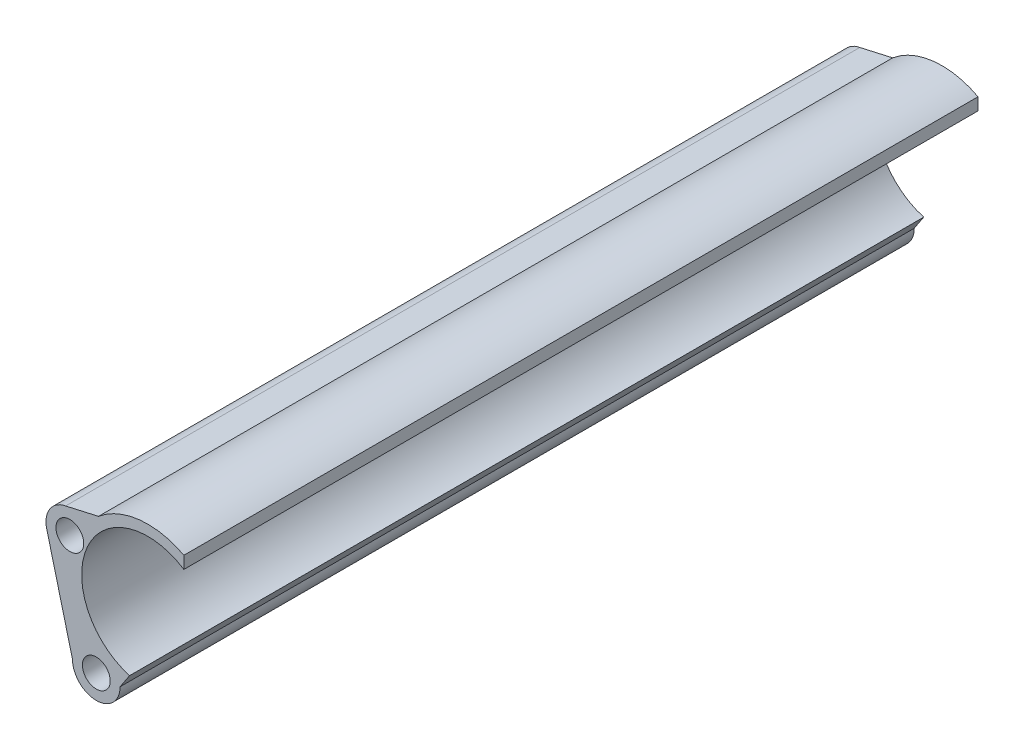
ISO-10303-21;
HEADER;
FILE_DESCRIPTION(('STEP AP214'),'2;1');
FILE_NAME('part.step','',(''),(''),'','','');
FILE_SCHEMA(('AUTOMOTIVE_DESIGN { 1 0 10303 214 1 1 1 1 }'));
ENDSEC;
DATA;
#1=APPLICATION_CONTEXT('core data for automotive mechanical design processes');
#2=APPLICATION_PROTOCOL_DEFINITION('international standard','automotive_design',2000,#1);
#3=PRODUCT_CONTEXT('',#1,'mechanical');
#4=PRODUCT('Part','Part','',(#3));
#5=PRODUCT_RELATED_PRODUCT_CATEGORY('part','',(#4));
#6=PRODUCT_DEFINITION_FORMATION('','',#4);
#7=PRODUCT_DEFINITION_CONTEXT('part definition',#1,'design');
#8=PRODUCT_DEFINITION('design','',#6,#7);
#9=PRODUCT_DEFINITION_SHAPE('','',#8);
#10=(LENGTH_UNIT() NAMED_UNIT(*) SI_UNIT(.MILLI.,.METRE.));
#11=(NAMED_UNIT(*) PLANE_ANGLE_UNIT() SI_UNIT($,.RADIAN.));
#12=(NAMED_UNIT(*) SI_UNIT($,.STERADIAN.) SOLID_ANGLE_UNIT());
#13=UNCERTAINTY_MEASURE_WITH_UNIT(LENGTH_MEASURE(1.E-05),#10,'distance_accuracy_value','');
#14=(GEOMETRIC_REPRESENTATION_CONTEXT(3) GLOBAL_UNCERTAINTY_ASSIGNED_CONTEXT((#13)) GLOBAL_UNIT_ASSIGNED_CONTEXT((#10,
#11,#12)) REPRESENTATION_CONTEXT('',''));
#15=CARTESIAN_POINT('',(0.,0.,0.));
#16=DIRECTION('',(0.,0.,1.));
#17=DIRECTION('',(1.,0.,0.));
#18=AXIS2_PLACEMENT_3D('',#15,#16,#17);
#19=CARTESIAN_POINT('',(21.5406787545616,4.51282461500229E-13,150.));
#20=DIRECTION('',(1.,0.,0.));
#21=DIRECTION('',(0.,1.,0.));
#22=AXIS2_PLACEMENT_3D('',#19,#20,#21);
#23=PLANE('',#22);
#24=DIRECTION('',(0.,-1.,0.));
#25=VECTOR('',#24,1.);
#26=CARTESIAN_POINT('',(21.5406787545616,4.51282461500229E-13,0.));
#27=LINE('',#26,#25);
#28=CARTESIAN_POINT('',(21.5406787545615,7.53128151458365,0.));
#29=VERTEX_POINT('',#28);
#30=CARTESIAN_POINT('',(21.5406787545615,5.21282360688181,0.));
#31=VERTEX_POINT('',#30);
#32=EDGE_CURVE('E135',#29,#31,#27,.T.);
#33=ORIENTED_EDGE('',*,*,#32,.F.);
#34=DIRECTION('',(0.,0.,-1.));
#35=VECTOR('',#34,1.);
#36=CARTESIAN_POINT('',(21.5406787545615,7.53128151458365,150.));
#37=LINE('',#36,#35);
#38=CARTESIAN_POINT('',(21.5406787545615,7.53128151458365,150.));
#39=VERTEX_POINT('',#38);
#40=EDGE_CURVE('E11',#39,#29,#37,.T.);
#41=ORIENTED_EDGE('',*,*,#40,.F.);
#42=DIRECTION('',(0.,-1.,0.));
#43=VECTOR('',#42,1.);
#44=CARTESIAN_POINT('',(21.5406787545616,4.51282461500229E-13,150.));
#45=LINE('',#44,#43);
#46=CARTESIAN_POINT('',(21.5406787545615,5.21282360688181,150.));
#47=VERTEX_POINT('',#46);
#48=EDGE_CURVE('E297',#39,#47,#45,.T.);
#49=ORIENTED_EDGE('',*,*,#48,.T.);
#50=DIRECTION('',(0.,0.,-1.));
#51=VECTOR('',#50,1.);
#52=CARTESIAN_POINT('',(21.5406787545615,5.21282360688181,150.));
#53=LINE('',#52,#51);
#54=EDGE_CURVE('E52',#47,#31,#53,.T.);
#55=ORIENTED_EDGE('',*,*,#54,.T.);
#56=EDGE_LOOP('',(#33,#41,#49,#55));
#57=FACE_BOUND('',#56,.T.);
#58=ADVANCED_FACE('F35',(#57),#23,.T.);
#59=CARTESIAN_POINT('',(14.7374063577215,-5.27361929309128,150.));
#60=DIRECTION('',(0.,0.,-1.));
#61=DIRECTION('',(-1.,0.,0.));
#62=AXIS2_PLACEMENT_3D('',#59,#60,#61);
#63=CYLINDRICAL_SURFACE('',#62,14.5);
#64=CARTESIAN_POINT('',(14.7374063577215,-5.27361929309128,0.));
#65=DIRECTION('',(0.,0.,1.));
#66=DIRECTION('',(1.,0.,0.));
#67=AXIS2_PLACEMENT_3D('',#64,#65,#66);
#68=CIRCLE('',#67,14.5);
#69=CARTESIAN_POINT('',(5.41957654231585,5.83619832607501,0.));
#70=VERTEX_POINT('',#69);
#71=EDGE_CURVE('E137',#29,#70,#68,.T.);
#72=ORIENTED_EDGE('',*,*,#71,.T.);
#73=DIRECTION('',(0.,0.,-1.));
#74=VECTOR('',#73,1.);
#75=CARTESIAN_POINT('',(5.41957654231585,5.83619832607501,150.));
#76=LINE('',#75,#74);
#77=CARTESIAN_POINT('',(5.41957654231585,5.83619832607501,150.));
#78=VERTEX_POINT('',#77);
#79=EDGE_CURVE('E44',#78,#70,#76,.T.);
#80=ORIENTED_EDGE('',*,*,#79,.F.);
#81=CARTESIAN_POINT('',(14.7374063577215,-5.27361929309128,150.));
#82=DIRECTION('',(0.,0.,1.));
#83=DIRECTION('',(1.,0.,0.));
#84=AXIS2_PLACEMENT_3D('',#81,#82,#83);
#85=CIRCLE('',#84,14.5);
#86=EDGE_CURVE('E293',#39,#78,#85,.T.);
#87=ORIENTED_EDGE('',*,*,#86,.F.);
#88=ORIENTED_EDGE('',*,*,#40,.T.);
#89=EDGE_LOOP('',(#72,#80,#87,#88));
#90=FACE_BOUND('',#89,.T.);
#91=ADVANCED_FACE('F174',(#90),#63,.T.);
#92=CARTESIAN_POINT('',(-0.992590841324967,4.38460661520937,150.));
#93=DIRECTION('',(0.220793854202999,-0.975320498065218,0.));
#94=DIRECTION('',(0.975320498065218,0.220793854202999,0.));
#95=AXIS2_PLACEMENT_3D('',#92,#93,#94);
#96=PLANE('',#95);
#97=DIRECTION('',(-0.975320498065218,-0.220793854202999,0.));
#98=VECTOR('',#97,1.);
#99=CARTESIAN_POINT('',(-0.992590841324967,4.38460661520937,0.));
#100=LINE('',#99,#98);
#101=CARTESIAN_POINT('',(-0.797555390004435,4.42875890062602,0.));
#102=VERTEX_POINT('',#101);
#103=EDGE_CURVE('E140',#70,#102,#100,.T.);
#104=ORIENTED_EDGE('',*,*,#103,.T.);
#105=DIRECTION('',(0.,0.,-1.));
#106=VECTOR('',#105,1.);
#107=CARTESIAN_POINT('',(-0.797555390004435,4.42875890062602,150.));
#108=LINE('',#107,#106);
#109=CARTESIAN_POINT('',(-0.797555390004435,4.42875890062602,150.));
#110=VERTEX_POINT('',#109);
#111=EDGE_CURVE('E162',#110,#102,#108,.T.);
#112=ORIENTED_EDGE('',*,*,#111,.F.);
#113=DIRECTION('',(-0.975320498065218,-0.220793854202999,0.));
#114=VECTOR('',#113,1.);
#115=CARTESIAN_POINT('',(-0.992590841324967,4.38460661520937,150.));
#116=LINE('',#115,#114);
#117=EDGE_CURVE('E170',#78,#110,#116,.T.);
#118=ORIENTED_EDGE('',*,*,#117,.F.);
#119=ORIENTED_EDGE('',*,*,#79,.T.);
#120=EDGE_LOOP('',(#104,#112,#118,#119));
#121=FACE_BOUND('',#120,.T.);
#122=ADVANCED_FACE('F167',(#121),#96,.F.);
#123=CARTESIAN_POINT('',(0.,0.,150.));
#124=DIRECTION('',(0.,0.,-1.));
#125=DIRECTION('',(-1.,0.,0.));
#126=AXIS2_PLACEMENT_3D('',#123,#124,#125);
#127=CYLINDRICAL_SURFACE('',#126,4.49999999999992);
#128=CARTESIAN_POINT('',(0.,0.,0.));
#129=DIRECTION('',(0.,0.,1.));
#130=DIRECTION('',(1.,0.,0.));
#131=AXIS2_PLACEMENT_3D('',#128,#129,#130);
#132=CIRCLE('',#131,4.49999999999992);
#133=CARTESIAN_POINT('',(-4.3580211919194,-1.12145052979643,0.));
#134=VERTEX_POINT('',#133);
#135=EDGE_CURVE('E143',#102,#134,#132,.T.);
#136=ORIENTED_EDGE('',*,*,#135,.T.);
#137=DIRECTION('',(0.,0.,-1.));
#138=VECTOR('',#137,1.);
#139=CARTESIAN_POINT('',(-4.3580211919194,-1.12145052979643,150.));
#140=LINE('',#139,#138);
#141=CARTESIAN_POINT('',(-4.3580211919194,-1.12145052979643,150.));
#142=VERTEX_POINT('',#141);
#143=EDGE_CURVE('E159',#142,#134,#140,.T.);
#144=ORIENTED_EDGE('',*,*,#143,.F.);
#145=CARTESIAN_POINT('',(0.,0.,150.));
#146=DIRECTION('',(0.,0.,1.));
#147=DIRECTION('',(1.,0.,0.));
#148=AXIS2_PLACEMENT_3D('',#145,#146,#147);
#149=CIRCLE('',#148,4.49999999999992);
#150=EDGE_CURVE('E291',#110,#142,#149,.T.);
#151=ORIENTED_EDGE('',*,*,#150,.F.);
#152=ORIENTED_EDGE('',*,*,#111,.T.);
#153=EDGE_LOOP('',(#136,#144,#151,#152));
#154=FACE_BOUND('',#153,.T.);
#155=ADVANCED_FACE('F216',(#154),#127,.T.);
#156=CARTESIAN_POINT('',(-4.35802119191901,-1.12145052979794,150.));
#157=DIRECTION('',(0.968449153759797,0.249211228843991,0.));
#158=DIRECTION('',(-0.249211228843991,0.968449153759797,0.));
#159=AXIS2_PLACEMENT_3D('',#156,#157,#158);
#160=PLANE('',#159);
#161=DIRECTION('',(0.249211228843991,-0.968449153759797,0.));
#162=VECTOR('',#161,1.);
#163=CARTESIAN_POINT('',(-4.35802119191901,-1.12145052979794,0.));
#164=LINE('',#163,#162);
#165=CARTESIAN_POINT('',(0.500000000000005,-20.,0.));
#166=VERTEX_POINT('',#165);
#167=EDGE_CURVE('E146',#134,#166,#164,.T.);
#168=ORIENTED_EDGE('',*,*,#167,.T.);
#169=DIRECTION('',(0.,0.,-1.));
#170=VECTOR('',#169,1.);
#171=CARTESIAN_POINT('',(0.500000000000005,-20.,150.));
#172=LINE('',#171,#170);
#173=CARTESIAN_POINT('',(0.500000000000005,-20.,150.));
#174=VERTEX_POINT('',#173);
#175=EDGE_CURVE('E121',#174,#166,#172,.T.);
#176=ORIENTED_EDGE('',*,*,#175,.F.);
#177=DIRECTION('',(0.249211228843991,-0.968449153759797,0.));
#178=VECTOR('',#177,1.);
#179=CARTESIAN_POINT('',(-4.35802119191901,-1.12145052979794,150.));
#180=LINE('',#179,#178);
#181=EDGE_CURVE('E110',#142,#174,#180,.T.);
#182=ORIENTED_EDGE('',*,*,#181,.F.);
#183=ORIENTED_EDGE('',*,*,#143,.T.);
#184=EDGE_LOOP('',(#168,#176,#182,#183));
#185=FACE_BOUND('',#184,.T.);
#186=ADVANCED_FACE('F213',(#185),#160,.F.);
#187=CARTESIAN_POINT('',(5.,-20.,150.));
#188=DIRECTION('',(0.,0.,-1.));
#189=DIRECTION('',(-1.,0.,0.));
#190=AXIS2_PLACEMENT_3D('',#187,#188,#189);
#191=CYLINDRICAL_SURFACE('',#190,4.5);
#192=CARTESIAN_POINT('',(5.,-20.,0.));
#193=DIRECTION('',(0.,0.,1.));
#194=DIRECTION('',(1.,0.,0.));
#195=AXIS2_PLACEMENT_3D('',#192,#193,#194);
#196=CIRCLE('',#195,4.5);
#197=CARTESIAN_POINT('',(9.5,-20.,0.));
#198=VERTEX_POINT('',#197);
#199=EDGE_CURVE('E118',#166,#198,#196,.T.);
#200=ORIENTED_EDGE('',*,*,#199,.T.);
#201=DIRECTION('',(0.,0.,-1.));
#202=VECTOR('',#201,1.);
#203=CARTESIAN_POINT('',(9.5,-20.,150.));
#204=LINE('',#203,#202);
#205=CARTESIAN_POINT('',(9.5,-20.,150.));
#206=VERTEX_POINT('',#205);
#207=EDGE_CURVE('E116',#206,#198,#204,.T.);
#208=ORIENTED_EDGE('',*,*,#207,.F.);
#209=CARTESIAN_POINT('',(5.,-20.,150.));
#210=DIRECTION('',(0.,0.,1.));
#211=DIRECTION('',(1.,0.,0.));
#212=AXIS2_PLACEMENT_3D('',#209,#210,#211);
#213=CIRCLE('',#212,4.5);
#214=EDGE_CURVE('E102',#174,#206,#213,.T.);
#215=ORIENTED_EDGE('',*,*,#214,.F.);
#216=ORIENTED_EDGE('',*,*,#175,.T.);
#217=EDGE_LOOP('',(#200,#208,#215,#216));
#218=FACE_BOUND('',#217,.T.);
#219=ADVANCED_FACE('F117',(#218),#191,.T.);
#220=CARTESIAN_POINT('',(15.8131741889703,-10.4107028907879,150.));
#221=DIRECTION('',(0.835240024776836,-0.54988553446221,0.));
#222=DIRECTION('',(0.54988553446221,0.835240024776836,0.));
#223=AXIS2_PLACEMENT_3D('',#220,#221,#222);
#224=PLANE('',#223);
#225=DIRECTION('',(-0.54988553446221,-0.835240024776836,0.));
#226=VECTOR('',#225,1.);
#227=CARTESIAN_POINT('',(15.8131741889703,-10.4107028907879,0.));
#228=LINE('',#227,#226);
#229=CARTESIAN_POINT('',(11.2857217695841,-17.2876058714098,0.));
#230=VERTEX_POINT('',#229);
#231=EDGE_CURVE('E150',#230,#198,#228,.T.);
#232=ORIENTED_EDGE('',*,*,#231,.F.);
#233=DIRECTION('',(0.,0.,-1.));
#234=VECTOR('',#233,1.);
#235=CARTESIAN_POINT('',(11.2857217695841,-17.2876058714098,150.));
#236=LINE('',#235,#234);
#237=CARTESIAN_POINT('',(11.2857217695841,-17.2876058714098,150.));
#238=VERTEX_POINT('',#237);
#239=EDGE_CURVE('E77',#238,#230,#236,.T.);
#240=ORIENTED_EDGE('',*,*,#239,.F.);
#241=DIRECTION('',(-0.54988553446221,-0.835240024776836,0.));
#242=VECTOR('',#241,1.);
#243=CARTESIAN_POINT('',(15.8131741889703,-10.4107028907879,150.));
#244=LINE('',#243,#242);
#245=EDGE_CURVE('E108',#238,#206,#244,.T.);
#246=ORIENTED_EDGE('',*,*,#245,.T.);
#247=ORIENTED_EDGE('',*,*,#207,.T.);
#248=EDGE_LOOP('',(#232,#240,#246,#247));
#249=FACE_BOUND('',#248,.T.);
#250=ADVANCED_FACE('F123',(#249),#224,.T.);
#251=CARTESIAN_POINT('',(5.,-20.,150.));
#252=DIRECTION('',(0.,0.,-1.));
#253=DIRECTION('',(-1.,0.,0.));
#254=AXIS2_PLACEMENT_3D('',#251,#252,#253);
#255=CYLINDRICAL_SURFACE('',#254,2.625);
#256=CARTESIAN_POINT('',(5.,-20.,150.));
#257=DIRECTION('',(0.,0.,1.));
#258=DIRECTION('',(1.,0.,0.));
#259=AXIS2_PLACEMENT_3D('',#256,#257,#258);
#260=CIRCLE('',#259,2.625);
#261=CARTESIAN_POINT('',(7.625,-20.,150.));
#262=VERTEX_POINT('',#261);
#263=EDGE_CURVE('E197',#262,#262,#260,.T.);
#264=ORIENTED_EDGE('',*,*,#263,.T.);
#265=EDGE_LOOP('',(#264));
#266=FACE_BOUND('',#265,.T.);
#267=CARTESIAN_POINT('',(5.,-20.,0.));
#268=DIRECTION('',(0.,0.,1.));
#269=DIRECTION('',(1.,0.,0.));
#270=AXIS2_PLACEMENT_3D('',#267,#268,#269);
#271=CIRCLE('',#270,2.625);
#272=CARTESIAN_POINT('',(7.625,-20.,0.));
#273=VERTEX_POINT('',#272);
#274=EDGE_CURVE('E132',#273,#273,#271,.T.);
#275=ORIENTED_EDGE('',*,*,#274,.F.);
#276=EDGE_LOOP('',(#275));
#277=FACE_BOUND('',#276,.T.);
#278=ADVANCED_FACE('F184',(#266,#277),#255,.F.);
#279=CARTESIAN_POINT('',(0.,0.,150.));
#280=DIRECTION('',(0.,0.,-1.));
#281=DIRECTION('',(-1.,0.,0.));
#282=AXIS2_PLACEMENT_3D('',#279,#280,#281);
#283=CYLINDRICAL_SURFACE('',#282,2.625);
#284=CARTESIAN_POINT('',(0.,0.,150.));
#285=DIRECTION('',(0.,0.,1.));
#286=DIRECTION('',(1.,0.,0.));
#287=AXIS2_PLACEMENT_3D('',#284,#285,#286);
#288=CIRCLE('',#287,2.625);
#289=CARTESIAN_POINT('',(2.625,0.,150.));
#290=VERTEX_POINT('',#289);
#291=EDGE_CURVE('E155',#290,#290,#288,.T.);
#292=ORIENTED_EDGE('',*,*,#291,.T.);
#293=EDGE_LOOP('',(#292));
#294=FACE_BOUND('',#293,.T.);
#295=CARTESIAN_POINT('',(0.,0.,0.));
#296=DIRECTION('',(0.,0.,1.));
#297=DIRECTION('',(1.,0.,0.));
#298=AXIS2_PLACEMENT_3D('',#295,#296,#297);
#299=CIRCLE('',#298,2.625);
#300=CARTESIAN_POINT('',(2.625,0.,0.));
#301=VERTEX_POINT('',#300);
#302=EDGE_CURVE('E129',#301,#301,#299,.T.);
#303=ORIENTED_EDGE('',*,*,#302,.F.);
#304=EDGE_LOOP('',(#303));
#305=FACE_BOUND('',#304,.T.);
#306=ADVANCED_FACE('F37',(#294,#305),#283,.F.);
#307=CARTESIAN_POINT('',(14.7374063577215,-5.27361929309128,150.));
#308=DIRECTION('',(0.,0.,-1.));
#309=DIRECTION('',(-1.,0.,0.));
#310=AXIS2_PLACEMENT_3D('',#307,#308,#309);
#311=CYLINDRICAL_SURFACE('',#310,12.5000000000001);
#312=CARTESIAN_POINT('',(14.7374063577215,-5.27361929309128,0.));
#313=DIRECTION('',(0.,0.,1.));
#314=DIRECTION('',(1.,0.,0.));
#315=AXIS2_PLACEMENT_3D('',#312,#313,#314);
#316=CIRCLE('',#315,12.5000000000001);
#317=EDGE_CURVE('E152',#31,#230,#316,.T.);
#318=ORIENTED_EDGE('',*,*,#317,.F.);
#319=ORIENTED_EDGE('',*,*,#54,.F.);
#320=CARTESIAN_POINT('',(14.7374063577215,-5.27361929309128,150.));
#321=DIRECTION('',(0.,0.,1.));
#322=DIRECTION('',(1.,0.,0.));
#323=AXIS2_PLACEMENT_3D('',#320,#321,#322);
#324=CIRCLE('',#323,12.5000000000001);
#325=EDGE_CURVE('E124',#47,#238,#324,.T.);
#326=ORIENTED_EDGE('',*,*,#325,.T.);
#327=ORIENTED_EDGE('',*,*,#239,.T.);
#328=EDGE_LOOP('',(#318,#319,#326,#327));
#329=FACE_BOUND('',#328,.T.);
#330=ADVANCED_FACE('F191',(#329),#311,.F.);
#331=CARTESIAN_POINT('',(0.,0.,150.));
#332=DIRECTION('',(0.,0.,1.));
#333=DIRECTION('',(1.,0.,0.));
#334=AXIS2_PLACEMENT_3D('',#331,#332,#333);
#335=PLANE('',#334);
#336=ORIENTED_EDGE('',*,*,#291,.F.);
#337=EDGE_LOOP('',(#336));
#338=FACE_BOUND('',#337,.T.);
#339=ORIENTED_EDGE('',*,*,#263,.F.);
#340=EDGE_LOOP('',(#339));
#341=FACE_BOUND('',#340,.T.);
#342=ORIENTED_EDGE('',*,*,#48,.F.);
#343=ORIENTED_EDGE('',*,*,#86,.T.);
#344=ORIENTED_EDGE('',*,*,#117,.T.);
#345=ORIENTED_EDGE('',*,*,#150,.T.);
#346=ORIENTED_EDGE('',*,*,#181,.T.);
#347=ORIENTED_EDGE('',*,*,#214,.T.);
#348=ORIENTED_EDGE('',*,*,#245,.F.);
#349=ORIENTED_EDGE('',*,*,#325,.F.);
#350=EDGE_LOOP('',(#342,#343,#344,#345,#346,#347,#348,#349));
#351=FACE_BOUND('',#350,.T.);
#352=ADVANCED_FACE('F105',(#338,#341,#351),#335,.T.);
#353=CARTESIAN_POINT('',(0.,0.,0.));
#354=DIRECTION('',(0.,0.,1.));
#355=DIRECTION('',(1.,0.,0.));
#356=AXIS2_PLACEMENT_3D('',#353,#354,#355);
#357=PLANE('',#356);
#358=ORIENTED_EDGE('',*,*,#302,.T.);
#359=EDGE_LOOP('',(#358));
#360=FACE_BOUND('',#359,.T.);
#361=ORIENTED_EDGE('',*,*,#274,.T.);
#362=EDGE_LOOP('',(#361));
#363=FACE_BOUND('',#362,.T.);
#364=ORIENTED_EDGE('',*,*,#32,.T.);
#365=ORIENTED_EDGE('',*,*,#317,.T.);
#366=ORIENTED_EDGE('',*,*,#231,.T.);
#367=ORIENTED_EDGE('',*,*,#199,.F.);
#368=ORIENTED_EDGE('',*,*,#167,.F.);
#369=ORIENTED_EDGE('',*,*,#135,.F.);
#370=ORIENTED_EDGE('',*,*,#103,.F.);
#371=ORIENTED_EDGE('',*,*,#71,.F.);
#372=EDGE_LOOP('',(#364,#365,#366,#367,#368,#369,#370,#371));
#373=FACE_BOUND('',#372,.T.);
#374=ADVANCED_FACE('F176',(#360,#363,#373),#357,.F.);
#375=CLOSED_SHELL('',(#58,#91,#122,#155,#186,#219,#250,#278,#306,#330,#352,#374));
#376=MANIFOLD_SOLID_BREP('B2',#375);
#377=ADVANCED_BREP_SHAPE_REPRESENTATION('',(#18,#376),#14);
#378=SHAPE_DEFINITION_REPRESENTATION(#9,#377);
ENDSEC;
END-ISO-10303-21;
